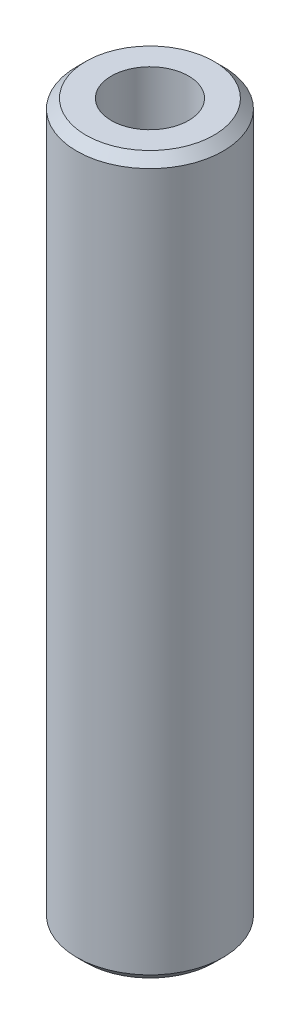
ISO-10303-21;
HEADER;
FILE_DESCRIPTION(('STEP AP214'),'2;1');
FILE_NAME('part.step','',(''),(''),'','','');
FILE_SCHEMA(('AUTOMOTIVE_DESIGN { 1 0 10303 214 1 1 1 1 }'));
ENDSEC;
DATA;
#1=APPLICATION_CONTEXT('core data for automotive mechanical design processes');
#2=APPLICATION_PROTOCOL_DEFINITION('international standard','automotive_design',2000,#1);
#3=PRODUCT_CONTEXT('',#1,'mechanical');
#4=PRODUCT('Part','Part','',(#3));
#5=PRODUCT_RELATED_PRODUCT_CATEGORY('part','',(#4));
#6=PRODUCT_DEFINITION_FORMATION('','',#4);
#7=PRODUCT_DEFINITION_CONTEXT('part definition',#1,'design');
#8=PRODUCT_DEFINITION('design','',#6,#7);
#9=PRODUCT_DEFINITION_SHAPE('','',#8);
#10=(LENGTH_UNIT() NAMED_UNIT(*) SI_UNIT(.MILLI.,.METRE.));
#11=(NAMED_UNIT(*) PLANE_ANGLE_UNIT() SI_UNIT($,.RADIAN.));
#12=(NAMED_UNIT(*) SI_UNIT($,.STERADIAN.) SOLID_ANGLE_UNIT());
#13=UNCERTAINTY_MEASURE_WITH_UNIT(LENGTH_MEASURE(1.E-05),#10,'distance_accuracy_value','');
#14=(GEOMETRIC_REPRESENTATION_CONTEXT(3) GLOBAL_UNCERTAINTY_ASSIGNED_CONTEXT((#13)) GLOBAL_UNIT_ASSIGNED_CONTEXT((#10,
#11,#12)) REPRESENTATION_CONTEXT('',''));
#15=CARTESIAN_POINT('',(0.,0.,0.));
#16=DIRECTION('',(0.,0.,1.));
#17=DIRECTION('',(1.,0.,0.));
#18=AXIS2_PLACEMENT_3D('',#15,#16,#17);
#19=CARTESIAN_POINT('',(0.,97.8815216792414,0.));
#20=DIRECTION('',(0.,-1.,0.));
#21=DIRECTION('',(0.,0.,-1.));
#22=AXIS2_PLACEMENT_3D('',#19,#20,#21);
#23=CYLINDRICAL_SURFACE('',#22,10.);
#24=CARTESIAN_POINT('',(0.,96.6244526872505,0.));
#25=DIRECTION('',(0.,1.,0.));
#26=DIRECTION('',(0.,0.,1.));
#27=AXIS2_PLACEMENT_3D('',#24,#25,#26);
#28=CIRCLE('',#27,10.);
#29=CARTESIAN_POINT('',(0.,96.6244526872505,10.));
#30=VERTEX_POINT('',#29);
#31=EDGE_CURVE('E50',#30,#30,#28,.F.);
#32=ORIENTED_EDGE('',*,*,#31,.T.);
#33=EDGE_LOOP('',(#32));
#34=FACE_BOUND('',#33,.T.);
#35=CARTESIAN_POINT('',(0.,1.25706899199084,0.));
#36=DIRECTION('',(0.,1.,0.));
#37=DIRECTION('',(0.,0.,1.));
#38=AXIS2_PLACEMENT_3D('',#35,#36,#37);
#39=CIRCLE('',#38,10.);
#40=CARTESIAN_POINT('',(0.,1.25706899199084,10.));
#41=VERTEX_POINT('',#40);
#42=EDGE_CURVE('E51',#41,#41,#39,.T.);
#43=ORIENTED_EDGE('',*,*,#42,.T.);
#44=EDGE_LOOP('',(#43));
#45=FACE_BOUND('',#44,.T.);
#46=ADVANCED_FACE('F39',(#34,#45),#23,.T.);
#47=CARTESIAN_POINT('',(0.,97.8815216792414,0.));
#48=DIRECTION('',(0.,1.,0.));
#49=DIRECTION('',(0.,0.,1.));
#50=AXIS2_PLACEMENT_3D('',#47,#48,#49);
#51=PLANE('',#50);
#52=CARTESIAN_POINT('',(0.,97.8815216792414,0.));
#53=DIRECTION('',(0.,1.,0.));
#54=DIRECTION('',(0.,0.,1.));
#55=AXIS2_PLACEMENT_3D('',#52,#53,#54);
#56=CIRCLE('',#55,8.74293100800914);
#57=CARTESIAN_POINT('',(0.,97.8815216792414,8.74293100800914));
#58=VERTEX_POINT('',#57);
#59=EDGE_CURVE('E54',#58,#58,#56,.T.);
#60=ORIENTED_EDGE('',*,*,#59,.T.);
#61=EDGE_LOOP('',(#60));
#62=FACE_BOUND('',#61,.T.);
#63=CARTESIAN_POINT('',(0.,97.8815216792414,0.));
#64=DIRECTION('',(0.,1.,0.));
#65=DIRECTION('',(0.,0.,1.));
#66=AXIS2_PLACEMENT_3D('',#63,#64,#65);
#67=CIRCLE('',#66,5.27467835231658);
#68=CARTESIAN_POINT('',(0.,97.8815216792414,5.27467835231658));
#69=VERTEX_POINT('',#68);
#70=EDGE_CURVE('E58',#69,#69,#67,.T.);
#71=ORIENTED_EDGE('',*,*,#70,.F.);
#72=EDGE_LOOP('',(#71));
#73=FACE_BOUND('',#72,.T.);
#74=ADVANCED_FACE('F69',(#62,#73),#51,.T.);
#75=CARTESIAN_POINT('',(0.,0.,0.));
#76=DIRECTION('',(0.,1.,0.));
#77=DIRECTION('',(0.,0.,1.));
#78=AXIS2_PLACEMENT_3D('',#75,#76,#77);
#79=PLANE('',#78);
#80=CARTESIAN_POINT('',(0.,0.,0.));
#81=DIRECTION('',(0.,1.,0.));
#82=DIRECTION('',(0.,0.,1.));
#83=AXIS2_PLACEMENT_3D('',#80,#81,#82);
#84=CIRCLE('',#83,8.74293100800916);
#85=CARTESIAN_POINT('',(0.,0.,8.74293100800916));
#86=VERTEX_POINT('',#85);
#87=EDGE_CURVE('E10',#86,#86,#84,.F.);
#88=ORIENTED_EDGE('',*,*,#87,.T.);
#89=EDGE_LOOP('',(#88));
#90=FACE_BOUND('',#89,.T.);
#91=CARTESIAN_POINT('',(0.,0.,0.));
#92=DIRECTION('',(0.,1.,0.));
#93=DIRECTION('',(0.,0.,1.));
#94=AXIS2_PLACEMENT_3D('',#91,#92,#93);
#95=CIRCLE('',#94,5.27467835231658);
#96=CARTESIAN_POINT('',(0.,0.,5.27467835231658));
#97=VERTEX_POINT('',#96);
#98=EDGE_CURVE('E63',#97,#97,#95,.T.);
#99=ORIENTED_EDGE('',*,*,#98,.T.);
#100=EDGE_LOOP('',(#99));
#101=FACE_BOUND('',#100,.T.);
#102=ADVANCED_FACE('F75',(#90,#101),#79,.F.);
#103=CARTESIAN_POINT('',(0.,97.8815216792414,0.));
#104=DIRECTION('',(0.,-1.,0.));
#105=DIRECTION('',(0.,0.,-1.));
#106=AXIS2_PLACEMENT_3D('',#103,#104,#105);
#107=CYLINDRICAL_SURFACE('',#106,5.27467835231658);
#108=ORIENTED_EDGE('',*,*,#70,.T.);
#109=EDGE_LOOP('',(#108));
#110=FACE_BOUND('',#109,.T.);
#111=ORIENTED_EDGE('',*,*,#98,.F.);
#112=EDGE_LOOP('',(#111));
#113=FACE_BOUND('',#112,.T.);
#114=ADVANCED_FACE('F70',(#110,#113),#107,.F.);
#115=CARTESIAN_POINT('',(0.,97.8815216792414,0.));
#116=DIRECTION('',(0.,-1.,0.));
#117=DIRECTION('',(0.,0.,-1.));
#118=AXIS2_PLACEMENT_3D('',#115,#116,#117);
#119=CONICAL_SURFACE('',#118,8.74293100800914,0.785398163397445);
#120=ORIENTED_EDGE('',*,*,#31,.F.);
#121=EDGE_LOOP('',(#120));
#122=FACE_BOUND('',#121,.T.);
#123=ORIENTED_EDGE('',*,*,#59,.F.);
#124=EDGE_LOOP('',(#123));
#125=FACE_BOUND('',#124,.T.);
#126=ADVANCED_FACE('F81',(#122,#125),#119,.T.);
#127=CARTESIAN_POINT('',(0.,1.25706899199084,0.));
#128=DIRECTION('',(0.,1.,0.));
#129=DIRECTION('',(0.,0.,1.));
#130=AXIS2_PLACEMENT_3D('',#127,#128,#129);
#131=CONICAL_SURFACE('',#130,10.,0.78539816339745);
#132=ORIENTED_EDGE('',*,*,#87,.F.);
#133=EDGE_LOOP('',(#132));
#134=FACE_BOUND('',#133,.T.);
#135=ORIENTED_EDGE('',*,*,#42,.F.);
#136=EDGE_LOOP('',(#135));
#137=FACE_BOUND('',#136,.T.);
#138=ADVANCED_FACE('F45',(#134,#137),#131,.T.);
#139=CLOSED_SHELL('',(#46,#74,#102,#114,#126,#138));
#140=MANIFOLD_SOLID_BREP('B2',#139);
#141=ADVANCED_BREP_SHAPE_REPRESENTATION('',(#18,#140),#14);
#142=SHAPE_DEFINITION_REPRESENTATION(#9,#141);
ENDSEC;
END-ISO-10303-21;
